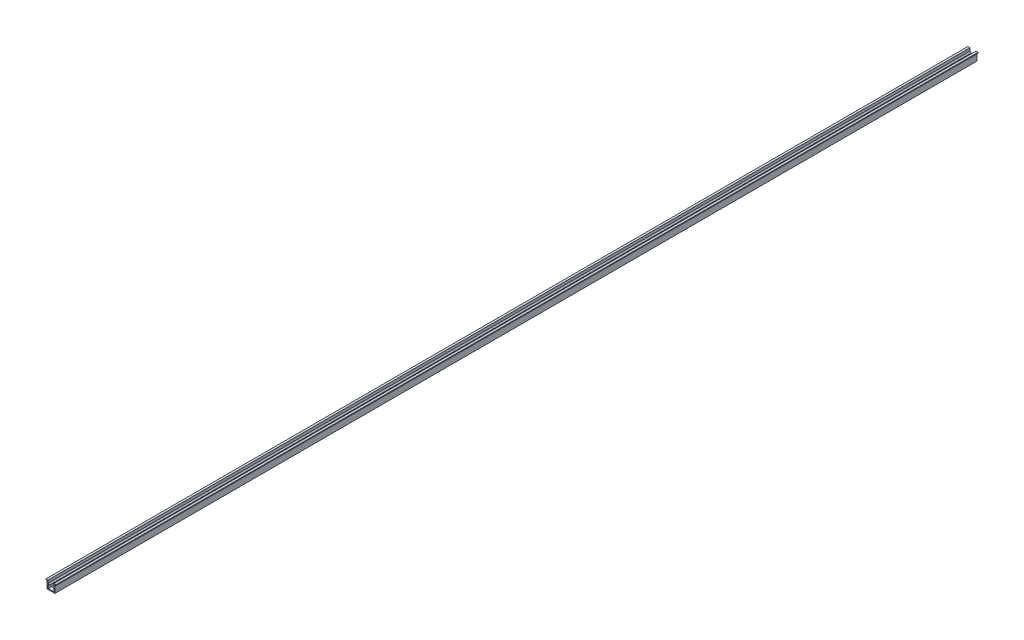
ISO-10303-21;
HEADER;
FILE_DESCRIPTION(('STEP AP214'),'2;1');
FILE_NAME('part.step','',(''),(''),'','','');
FILE_SCHEMA(('AUTOMOTIVE_DESIGN { 1 0 10303 214 1 1 1 1 }'));
ENDSEC;
DATA;
#1=APPLICATION_CONTEXT('core data for automotive mechanical design processes');
#2=APPLICATION_PROTOCOL_DEFINITION('international standard','automotive_design',2000,#1);
#3=PRODUCT_CONTEXT('',#1,'mechanical');
#4=PRODUCT('Part','Part','',(#3));
#5=PRODUCT_RELATED_PRODUCT_CATEGORY('part','',(#4));
#6=PRODUCT_DEFINITION_FORMATION('','',#4);
#7=PRODUCT_DEFINITION_CONTEXT('part definition',#1,'design');
#8=PRODUCT_DEFINITION('design','',#6,#7);
#9=PRODUCT_DEFINITION_SHAPE('','',#8);
#10=(LENGTH_UNIT() NAMED_UNIT(*) SI_UNIT(.MILLI.,.METRE.));
#11=(NAMED_UNIT(*) PLANE_ANGLE_UNIT() SI_UNIT($,.RADIAN.));
#12=(NAMED_UNIT(*) SI_UNIT($,.STERADIAN.) SOLID_ANGLE_UNIT());
#13=UNCERTAINTY_MEASURE_WITH_UNIT(LENGTH_MEASURE(1.E-05),#10,'distance_accuracy_value','');
#14=(GEOMETRIC_REPRESENTATION_CONTEXT(3) GLOBAL_UNCERTAINTY_ASSIGNED_CONTEXT((#13)) GLOBAL_UNIT_ASSIGNED_CONTEXT((#10,
#11,#12)) REPRESENTATION_CONTEXT('',''));
#15=CARTESIAN_POINT('',(0.,0.,0.));
#16=DIRECTION('',(0.,0.,1.));
#17=DIRECTION('',(1.,0.,0.));
#18=AXIS2_PLACEMENT_3D('',#15,#16,#17);
#19=CARTESIAN_POINT('',(-4.15,0.,1000.));
#20=DIRECTION('',(1.,0.,0.));
#21=DIRECTION('',(0.,0.,-1.));
#22=AXIS2_PLACEMENT_3D('',#19,#20,#21);
#23=PLANE('',#22);
#24=DIRECTION('',(0.,-1.,0.));
#25=VECTOR('',#24,1.);
#26=CARTESIAN_POINT('',(-4.15,0.,0.));
#27=LINE('',#26,#25);
#28=CARTESIAN_POINT('',(-4.15,8.,0.));
#29=VERTEX_POINT('',#28);
#30=CARTESIAN_POINT('',(-4.15,0.,0.));
#31=VERTEX_POINT('',#30);
#32=EDGE_CURVE('E203',#29,#31,#27,.T.);
#33=ORIENTED_EDGE('',*,*,#32,.T.);
#34=DIRECTION('',(0.,0.,-1.));
#35=VECTOR('',#34,1.);
#36=CARTESIAN_POINT('',(-4.15,0.,1000.));
#37=LINE('',#36,#35);
#38=CARTESIAN_POINT('',(-4.15,0.,1000.));
#39=VERTEX_POINT('',#38);
#40=EDGE_CURVE('E11',#39,#31,#37,.T.);
#41=ORIENTED_EDGE('',*,*,#40,.F.);
#42=DIRECTION('',(0.,-1.,0.));
#43=VECTOR('',#42,1.);
#44=CARTESIAN_POINT('',(-4.15,0.,1000.));
#45=LINE('',#44,#43);
#46=CARTESIAN_POINT('',(-4.15,8.,1000.));
#47=VERTEX_POINT('',#46);
#48=EDGE_CURVE('E241',#47,#39,#45,.T.);
#49=ORIENTED_EDGE('',*,*,#48,.F.);
#50=DIRECTION('',(0.,0.,-1.));
#51=VECTOR('',#50,1.);
#52=CARTESIAN_POINT('',(-4.15,8.,1000.));
#53=LINE('',#52,#51);
#54=EDGE_CURVE('E199',#47,#29,#53,.T.);
#55=ORIENTED_EDGE('',*,*,#54,.T.);
#56=EDGE_LOOP('',(#33,#41,#49,#55));
#57=FACE_BOUND('',#56,.T.);
#58=ADVANCED_FACE('F35',(#57),#23,.F.);
#59=CARTESIAN_POINT('',(4.15,0.,1000.));
#60=DIRECTION('',(0.,1.,0.));
#61=DIRECTION('',(-1.,0.,0.));
#62=AXIS2_PLACEMENT_3D('',#59,#60,#61);
#63=PLANE('',#62);
#64=DIRECTION('',(1.,0.,0.));
#65=VECTOR('',#64,1.);
#66=CARTESIAN_POINT('',(4.15,0.,0.));
#67=LINE('',#66,#65);
#68=CARTESIAN_POINT('',(4.15,0.,0.));
#69=VERTEX_POINT('',#68);
#70=EDGE_CURVE('E206',#31,#69,#67,.T.);
#71=ORIENTED_EDGE('',*,*,#70,.T.);
#72=DIRECTION('',(0.,0.,-1.));
#73=VECTOR('',#72,1.);
#74=CARTESIAN_POINT('',(4.15,0.,1000.));
#75=LINE('',#74,#73);
#76=CARTESIAN_POINT('',(4.15,0.,1000.));
#77=VERTEX_POINT('',#76);
#78=EDGE_CURVE('E43',#77,#69,#75,.T.);
#79=ORIENTED_EDGE('',*,*,#78,.F.);
#80=DIRECTION('',(1.,0.,0.));
#81=VECTOR('',#80,1.);
#82=CARTESIAN_POINT('',(4.15,0.,1000.));
#83=LINE('',#82,#81);
#84=EDGE_CURVE('E130',#39,#77,#83,.T.);
#85=ORIENTED_EDGE('',*,*,#84,.F.);
#86=ORIENTED_EDGE('',*,*,#40,.T.);
#87=EDGE_LOOP('',(#71,#79,#85,#86));
#88=FACE_BOUND('',#87,.T.);
#89=ADVANCED_FACE('F359',(#88),#63,.F.);
#90=CARTESIAN_POINT('',(4.15,0.,1000.));
#91=DIRECTION('',(-1.,0.,0.));
#92=DIRECTION('',(0.,0.,1.));
#93=AXIS2_PLACEMENT_3D('',#90,#91,#92);
#94=PLANE('',#93);
#95=DIRECTION('',(0.,1.,0.));
#96=VECTOR('',#95,1.);
#97=CARTESIAN_POINT('',(4.15,0.,0.));
#98=LINE('',#97,#96);
#99=CARTESIAN_POINT('',(4.15,8.,0.));
#100=VERTEX_POINT('',#99);
#101=EDGE_CURVE('E208',#69,#100,#98,.T.);
#102=ORIENTED_EDGE('',*,*,#101,.T.);
#103=DIRECTION('',(0.,0.,-1.));
#104=VECTOR('',#103,1.);
#105=CARTESIAN_POINT('',(4.15,8.,1000.));
#106=LINE('',#105,#104);
#107=CARTESIAN_POINT('',(4.15,8.,1000.));
#108=VERTEX_POINT('',#107);
#109=EDGE_CURVE('E284',#108,#100,#106,.T.);
#110=ORIENTED_EDGE('',*,*,#109,.F.);
#111=DIRECTION('',(0.,1.,0.));
#112=VECTOR('',#111,1.);
#113=CARTESIAN_POINT('',(4.15,0.,1000.));
#114=LINE('',#113,#112);
#115=EDGE_CURVE('E292',#77,#108,#114,.T.);
#116=ORIENTED_EDGE('',*,*,#115,.F.);
#117=ORIENTED_EDGE('',*,*,#78,.T.);
#118=EDGE_LOOP('',(#102,#110,#116,#117));
#119=FACE_BOUND('',#118,.T.);
#120=ADVANCED_FACE('F290',(#119),#94,.F.);
#121=CARTESIAN_POINT('',(4.15,8.,1000.));
#122=DIRECTION('',(0.,1.,0.));
#123=DIRECTION('',(-1.,0.,0.));
#124=AXIS2_PLACEMENT_3D('',#121,#122,#123);
#125=PLANE('',#124);
#126=DIRECTION('',(1.,0.,0.));
#127=VECTOR('',#126,1.);
#128=CARTESIAN_POINT('',(4.15,8.,0.));
#129=LINE('',#128,#127);
#130=CARTESIAN_POINT('',(5.5,8.,0.));
#131=VERTEX_POINT('',#130);
#132=EDGE_CURVE('E210',#100,#131,#129,.T.);
#133=ORIENTED_EDGE('',*,*,#132,.T.);
#134=DIRECTION('',(0.,0.,-1.));
#135=VECTOR('',#134,1.);
#136=CARTESIAN_POINT('',(5.5,8.,1000.));
#137=LINE('',#136,#135);
#138=CARTESIAN_POINT('',(5.5,8.,1000.));
#139=VERTEX_POINT('',#138);
#140=EDGE_CURVE('E281',#139,#131,#137,.T.);
#141=ORIENTED_EDGE('',*,*,#140,.F.);
#142=DIRECTION('',(1.,0.,0.));
#143=VECTOR('',#142,1.);
#144=CARTESIAN_POINT('',(4.15,8.,1000.));
#145=LINE('',#144,#143);
#146=EDGE_CURVE('E310',#108,#139,#145,.T.);
#147=ORIENTED_EDGE('',*,*,#146,.F.);
#148=ORIENTED_EDGE('',*,*,#109,.T.);
#149=EDGE_LOOP('',(#133,#141,#147,#148));
#150=FACE_BOUND('',#149,.T.);
#151=ADVANCED_FACE('F301',(#150),#125,.F.);
#152=CARTESIAN_POINT('',(5.5,8.,1000.));
#153=DIRECTION('',(-1.,0.,0.));
#154=DIRECTION('',(0.,0.,1.));
#155=AXIS2_PLACEMENT_3D('',#152,#153,#154);
#156=PLANE('',#155);
#157=DIRECTION('',(0.,1.,0.));
#158=VECTOR('',#157,1.);
#159=CARTESIAN_POINT('',(5.5,8.,0.));
#160=LINE('',#159,#158);
#161=CARTESIAN_POINT('',(5.5,9.,0.));
#162=VERTEX_POINT('',#161);
#163=EDGE_CURVE('E212',#131,#162,#160,.T.);
#164=ORIENTED_EDGE('',*,*,#163,.T.);
#165=DIRECTION('',(0.,0.,-1.));
#166=VECTOR('',#165,1.);
#167=CARTESIAN_POINT('',(5.5,9.,1000.));
#168=LINE('',#167,#166);
#169=CARTESIAN_POINT('',(5.5,9.,1000.));
#170=VERTEX_POINT('',#169);
#171=EDGE_CURVE('E278',#170,#162,#168,.T.);
#172=ORIENTED_EDGE('',*,*,#171,.F.);
#173=DIRECTION('',(0.,1.,0.));
#174=VECTOR('',#173,1.);
#175=CARTESIAN_POINT('',(5.5,8.,1000.));
#176=LINE('',#175,#174);
#177=EDGE_CURVE('E307',#139,#170,#176,.T.);
#178=ORIENTED_EDGE('',*,*,#177,.F.);
#179=ORIENTED_EDGE('',*,*,#140,.T.);
#180=EDGE_LOOP('',(#164,#172,#178,#179));
#181=FACE_BOUND('',#180,.T.);
#182=ADVANCED_FACE('F305',(#181),#156,.F.);
#183=CARTESIAN_POINT('',(5.5,9.,1000.));
#184=DIRECTION('',(0.,-1.,0.));
#185=DIRECTION('',(1.,0.,0.));
#186=AXIS2_PLACEMENT_3D('',#183,#184,#185);
#187=PLANE('',#186);
#188=DIRECTION('',(-1.,0.,0.));
#189=VECTOR('',#188,1.);
#190=CARTESIAN_POINT('',(5.5,9.,0.));
#191=LINE('',#190,#189);
#192=CARTESIAN_POINT('',(3.15,9.,0.));
#193=VERTEX_POINT('',#192);
#194=EDGE_CURVE('E214',#162,#193,#191,.T.);
#195=ORIENTED_EDGE('',*,*,#194,.T.);
#196=DIRECTION('',(0.,0.,-1.));
#197=VECTOR('',#196,1.);
#198=CARTESIAN_POINT('',(3.15,9.,1000.));
#199=LINE('',#198,#197);
#200=CARTESIAN_POINT('',(3.15,9.,1000.));
#201=VERTEX_POINT('',#200);
#202=EDGE_CURVE('E275',#201,#193,#199,.T.);
#203=ORIENTED_EDGE('',*,*,#202,.F.);
#204=DIRECTION('',(-1.,0.,0.));
#205=VECTOR('',#204,1.);
#206=CARTESIAN_POINT('',(5.5,9.,1000.));
#207=LINE('',#206,#205);
#208=EDGE_CURVE('E309',#170,#201,#207,.T.);
#209=ORIENTED_EDGE('',*,*,#208,.F.);
#210=ORIENTED_EDGE('',*,*,#171,.T.);
#211=EDGE_LOOP('',(#195,#203,#209,#210));
#212=FACE_BOUND('',#211,.T.);
#213=ADVANCED_FACE('F372',(#212),#187,.F.);
#214=CARTESIAN_POINT('',(3.15,9.,1000.));
#215=DIRECTION('',(1.,0.,0.));
#216=DIRECTION('',(0.,1.,0.));
#217=AXIS2_PLACEMENT_3D('',#214,#215,#216);
#218=PLANE('',#217);
#219=DIRECTION('',(0.,-1.,0.));
#220=VECTOR('',#219,1.);
#221=CARTESIAN_POINT('',(3.15,9.,0.));
#222=LINE('',#221,#220);
#223=CARTESIAN_POINT('',(3.15,6.,0.));
#224=VERTEX_POINT('',#223);
#225=EDGE_CURVE('E216',#193,#224,#222,.T.);
#226=ORIENTED_EDGE('',*,*,#225,.T.);
#227=DIRECTION('',(0.,0.,-1.));
#228=VECTOR('',#227,1.);
#229=CARTESIAN_POINT('',(3.15,6.,1000.));
#230=LINE('',#229,#228);
#231=CARTESIAN_POINT('',(3.15,6.,1000.));
#232=VERTEX_POINT('',#231);
#233=EDGE_CURVE('E272',#232,#224,#230,.T.);
#234=ORIENTED_EDGE('',*,*,#233,.F.);
#235=DIRECTION('',(0.,-1.,0.));
#236=VECTOR('',#235,1.);
#237=CARTESIAN_POINT('',(3.15,9.,1000.));
#238=LINE('',#237,#236);
#239=EDGE_CURVE('E312',#201,#232,#238,.T.);
#240=ORIENTED_EDGE('',*,*,#239,.F.);
#241=ORIENTED_EDGE('',*,*,#202,.T.);
#242=EDGE_LOOP('',(#226,#234,#240,#241));
#243=FACE_BOUND('',#242,.T.);
#244=ADVANCED_FACE('F375',(#243),#218,.F.);
#245=CARTESIAN_POINT('',(3.15,6.,1000.));
#246=DIRECTION('',(0.707106781186546,-0.707106781186549,0.));
#247=DIRECTION('',(0.707106781186549,0.707106781186546,0.));
#248=AXIS2_PLACEMENT_3D('',#245,#246,#247);
#249=PLANE('',#248);
#250=DIRECTION('',(-0.707106781186549,-0.707106781186546,0.));
#251=VECTOR('',#250,1.);
#252=CARTESIAN_POINT('',(3.15,6.,0.));
#253=LINE('',#252,#251);
#254=CARTESIAN_POINT('',(1.87720779386421,4.72720779386422,0.));
#255=VERTEX_POINT('',#254);
#256=EDGE_CURVE('E218',#224,#255,#253,.T.);
#257=ORIENTED_EDGE('',*,*,#256,.T.);
#258=DIRECTION('',(0.,0.,-1.));
#259=VECTOR('',#258,1.);
#260=CARTESIAN_POINT('',(1.87720779386421,4.72720779386422,1000.));
#261=LINE('',#260,#259);
#262=CARTESIAN_POINT('',(1.87720779386421,4.72720779386422,1000.));
#263=VERTEX_POINT('',#262);
#264=EDGE_CURVE('E269',#263,#255,#261,.T.);
#265=ORIENTED_EDGE('',*,*,#264,.F.);
#266=DIRECTION('',(-0.707106781186549,-0.707106781186546,0.));
#267=VECTOR('',#266,1.);
#268=CARTESIAN_POINT('',(3.15,6.,1000.));
#269=LINE('',#268,#267);
#270=EDGE_CURVE('E318',#232,#263,#269,.T.);
#271=ORIENTED_EDGE('',*,*,#270,.F.);
#272=ORIENTED_EDGE('',*,*,#233,.T.);
#273=EDGE_LOOP('',(#257,#265,#271,#272));
#274=FACE_BOUND('',#273,.T.);
#275=ADVANCED_FACE('F379',(#274),#249,.F.);
#276=CARTESIAN_POINT('',(1.87720779386421,4.72720779386422,1000.));
#277=DIRECTION('',(0.707106781186549,0.707106781186546,0.));
#278=DIRECTION('',(-0.707106781186546,0.707106781186549,0.));
#279=AXIS2_PLACEMENT_3D('',#276,#277,#278);
#280=PLANE('',#279);
#281=DIRECTION('',(0.707106781186546,-0.707106781186549,0.));
#282=VECTOR('',#281,1.);
#283=CARTESIAN_POINT('',(1.87720779386421,4.72720779386422,0.));
#284=LINE('',#283,#282);
#285=CARTESIAN_POINT('',(2.44289321881345,4.16152236891498,0.));
#286=VERTEX_POINT('',#285);
#287=EDGE_CURVE('E220',#255,#286,#284,.T.);
#288=ORIENTED_EDGE('',*,*,#287,.T.);
#289=DIRECTION('',(0.,0.,-1.));
#290=VECTOR('',#289,1.);
#291=CARTESIAN_POINT('',(2.44289321881345,4.16152236891498,1000.));
#292=LINE('',#291,#290);
#293=CARTESIAN_POINT('',(2.44289321881345,4.16152236891498,1000.));
#294=VERTEX_POINT('',#293);
#295=EDGE_CURVE('E266',#294,#286,#292,.T.);
#296=ORIENTED_EDGE('',*,*,#295,.F.);
#297=DIRECTION('',(0.707106781186546,-0.707106781186549,0.));
#298=VECTOR('',#297,1.);
#299=CARTESIAN_POINT('',(1.87720779386421,4.72720779386422,1000.));
#300=LINE('',#299,#298);
#301=EDGE_CURVE('E320',#263,#294,#300,.T.);
#302=ORIENTED_EDGE('',*,*,#301,.F.);
#303=ORIENTED_EDGE('',*,*,#264,.T.);
#304=EDGE_LOOP('',(#288,#296,#302,#303));
#305=FACE_BOUND('',#304,.T.);
#306=ADVANCED_FACE('F383',(#305),#280,.F.);
#307=CARTESIAN_POINT('',(2.44289321881345,4.16152236891498,1000.));
#308=DIRECTION('',(-0.707106781186546,0.707106781186549,0.));
#309=DIRECTION('',(-0.707106781186549,-0.707106781186546,0.));
#310=AXIS2_PLACEMENT_3D('',#307,#308,#309);
#311=PLANE('',#310);
#312=DIRECTION('',(0.707106781186549,0.707106781186546,0.));
#313=VECTOR('',#312,1.);
#314=CARTESIAN_POINT('',(2.44289321881345,4.16152236891498,0.));
#315=LINE('',#314,#313);
#316=CARTESIAN_POINT('',(3.15,4.86862915010153,0.));
#317=VERTEX_POINT('',#316);
#318=EDGE_CURVE('E222',#286,#317,#315,.T.);
#319=ORIENTED_EDGE('',*,*,#318,.T.);
#320=DIRECTION('',(0.,0.,-1.));
#321=VECTOR('',#320,1.);
#322=CARTESIAN_POINT('',(3.15,4.86862915010153,1000.));
#323=LINE('',#322,#321);
#324=CARTESIAN_POINT('',(3.15,4.86862915010153,1000.));
#325=VERTEX_POINT('',#324);
#326=EDGE_CURVE('E263',#325,#317,#323,.T.);
#327=ORIENTED_EDGE('',*,*,#326,.F.);
#328=DIRECTION('',(0.707106781186549,0.707106781186546,0.));
#329=VECTOR('',#328,1.);
#330=CARTESIAN_POINT('',(2.44289321881345,4.16152236891498,1000.));
#331=LINE('',#330,#329);
#332=EDGE_CURVE('E322',#294,#325,#331,.T.);
#333=ORIENTED_EDGE('',*,*,#332,.F.);
#334=ORIENTED_EDGE('',*,*,#295,.T.);
#335=EDGE_LOOP('',(#319,#327,#333,#334));
#336=FACE_BOUND('',#335,.T.);
#337=ADVANCED_FACE('F387',(#336),#311,.F.);
#338=CARTESIAN_POINT('',(3.15,4.86862915010153,1000.));
#339=DIRECTION('',(1.,0.,0.));
#340=DIRECTION('',(0.,1.,0.));
#341=AXIS2_PLACEMENT_3D('',#338,#339,#340);
#342=PLANE('',#341);
#343=DIRECTION('',(0.,-1.,0.));
#344=VECTOR('',#343,1.);
#345=CARTESIAN_POINT('',(3.15,4.86862915010153,0.));
#346=LINE('',#345,#344);
#347=CARTESIAN_POINT('',(3.15,1.,0.));
#348=VERTEX_POINT('',#347);
#349=EDGE_CURVE('E224',#317,#348,#346,.T.);
#350=ORIENTED_EDGE('',*,*,#349,.T.);
#351=DIRECTION('',(0.,0.,-1.));
#352=VECTOR('',#351,1.);
#353=CARTESIAN_POINT('',(3.15,1.,1000.));
#354=LINE('',#353,#352);
#355=CARTESIAN_POINT('',(3.15,1.,1000.));
#356=VERTEX_POINT('',#355);
#357=EDGE_CURVE('E260',#356,#348,#354,.T.);
#358=ORIENTED_EDGE('',*,*,#357,.F.);
#359=DIRECTION('',(0.,-1.,0.));
#360=VECTOR('',#359,1.);
#361=CARTESIAN_POINT('',(3.15,4.86862915010153,1000.));
#362=LINE('',#361,#360);
#363=EDGE_CURVE('E324',#325,#356,#362,.T.);
#364=ORIENTED_EDGE('',*,*,#363,.F.);
#365=ORIENTED_EDGE('',*,*,#326,.T.);
#366=EDGE_LOOP('',(#350,#358,#364,#365));
#367=FACE_BOUND('',#366,.T.);
#368=ADVANCED_FACE('F391',(#367),#342,.F.);
#369=CARTESIAN_POINT('',(-3.15,1.,1000.));
#370=DIRECTION('',(0.,-1.,0.));
#371=DIRECTION('',(1.,0.,0.));
#372=AXIS2_PLACEMENT_3D('',#369,#370,#371);
#373=PLANE('',#372);
#374=DIRECTION('',(-1.,0.,0.));
#375=VECTOR('',#374,1.);
#376=CARTESIAN_POINT('',(-3.15,1.,0.));
#377=LINE('',#376,#375);
#378=CARTESIAN_POINT('',(-3.15,1.,0.));
#379=VERTEX_POINT('',#378);
#380=EDGE_CURVE('E226',#348,#379,#377,.T.);
#381=ORIENTED_EDGE('',*,*,#380,.T.);
#382=DIRECTION('',(0.,0.,-1.));
#383=VECTOR('',#382,1.);
#384=CARTESIAN_POINT('',(-3.15,1.,1000.));
#385=LINE('',#384,#383);
#386=CARTESIAN_POINT('',(-3.15,1.,1000.));
#387=VERTEX_POINT('',#386);
#388=EDGE_CURVE('E257',#387,#379,#385,.T.);
#389=ORIENTED_EDGE('',*,*,#388,.F.);
#390=DIRECTION('',(-1.,0.,0.));
#391=VECTOR('',#390,1.);
#392=CARTESIAN_POINT('',(-3.15,1.,1000.));
#393=LINE('',#392,#391);
#394=EDGE_CURVE('E326',#356,#387,#393,.T.);
#395=ORIENTED_EDGE('',*,*,#394,.F.);
#396=ORIENTED_EDGE('',*,*,#357,.T.);
#397=EDGE_LOOP('',(#381,#389,#395,#396));
#398=FACE_BOUND('',#397,.T.);
#399=ADVANCED_FACE('F395',(#398),#373,.F.);
#400=CARTESIAN_POINT('',(-3.15,4.86862915010152,1000.));
#401=DIRECTION('',(-1.,0.,0.));
#402=DIRECTION('',(0.,-1.,0.));
#403=AXIS2_PLACEMENT_3D('',#400,#401,#402);
#404=PLANE('',#403);
#405=DIRECTION('',(0.,1.,0.));
#406=VECTOR('',#405,1.);
#407=CARTESIAN_POINT('',(-3.15,4.86862915010152,0.));
#408=LINE('',#407,#406);
#409=CARTESIAN_POINT('',(-3.15,4.86862915010152,0.));
#410=VERTEX_POINT('',#409);
#411=EDGE_CURVE('E228',#379,#410,#408,.T.);
#412=ORIENTED_EDGE('',*,*,#411,.T.);
#413=DIRECTION('',(0.,0.,-1.));
#414=VECTOR('',#413,1.);
#415=CARTESIAN_POINT('',(-3.15,4.86862915010152,1000.));
#416=LINE('',#415,#414);
#417=CARTESIAN_POINT('',(-3.15,4.86862915010152,1000.));
#418=VERTEX_POINT('',#417);
#419=EDGE_CURVE('E254',#418,#410,#416,.T.);
#420=ORIENTED_EDGE('',*,*,#419,.F.);
#421=DIRECTION('',(0.,1.,0.));
#422=VECTOR('',#421,1.);
#423=CARTESIAN_POINT('',(-3.15,4.86862915010152,1000.));
#424=LINE('',#423,#422);
#425=EDGE_CURVE('E328',#387,#418,#424,.T.);
#426=ORIENTED_EDGE('',*,*,#425,.F.);
#427=ORIENTED_EDGE('',*,*,#388,.T.);
#428=EDGE_LOOP('',(#412,#420,#426,#427));
#429=FACE_BOUND('',#428,.T.);
#430=ADVANCED_FACE('F399',(#429),#404,.F.);
#431=CARTESIAN_POINT('',(-2.44289321881345,4.16152236891498,1000.));
#432=DIRECTION('',(0.707106781186546,0.707106781186549,0.));
#433=DIRECTION('',(-0.707106781186549,0.707106781186546,0.));
#434=AXIS2_PLACEMENT_3D('',#431,#432,#433);
#435=PLANE('',#434);
#436=DIRECTION('',(0.707106781186549,-0.707106781186546,0.));
#437=VECTOR('',#436,1.);
#438=CARTESIAN_POINT('',(-2.44289321881345,4.16152236891498,0.));
#439=LINE('',#438,#437);
#440=CARTESIAN_POINT('',(-2.44289321881345,4.16152236891498,0.));
#441=VERTEX_POINT('',#440);
#442=EDGE_CURVE('E230',#410,#441,#439,.T.);
#443=ORIENTED_EDGE('',*,*,#442,.T.);
#444=DIRECTION('',(0.,0.,-1.));
#445=VECTOR('',#444,1.);
#446=CARTESIAN_POINT('',(-2.44289321881345,4.16152236891498,1000.));
#447=LINE('',#446,#445);
#448=CARTESIAN_POINT('',(-2.44289321881345,4.16152236891498,1000.));
#449=VERTEX_POINT('',#448);
#450=EDGE_CURVE('E251',#449,#441,#447,.T.);
#451=ORIENTED_EDGE('',*,*,#450,.F.);
#452=DIRECTION('',(0.707106781186549,-0.707106781186546,0.));
#453=VECTOR('',#452,1.);
#454=CARTESIAN_POINT('',(-2.44289321881345,4.16152236891498,1000.));
#455=LINE('',#454,#453);
#456=EDGE_CURVE('E330',#418,#449,#455,.T.);
#457=ORIENTED_EDGE('',*,*,#456,.F.);
#458=ORIENTED_EDGE('',*,*,#419,.T.);
#459=EDGE_LOOP('',(#443,#451,#457,#458));
#460=FACE_BOUND('',#459,.T.);
#461=ADVANCED_FACE('F403',(#460),#435,.F.);
#462=CARTESIAN_POINT('',(-1.87720779386421,4.72720779386422,1000.));
#463=DIRECTION('',(-0.70710678118655,0.707106781186545,0.));
#464=DIRECTION('',(-0.707106781186545,-0.70710678118655,0.));
#465=AXIS2_PLACEMENT_3D('',#462,#463,#464);
#466=PLANE('',#465);
#467=DIRECTION('',(0.707106781186545,0.70710678118655,0.));
#468=VECTOR('',#467,1.);
#469=CARTESIAN_POINT('',(-1.87720779386421,4.72720779386422,0.));
#470=LINE('',#469,#468);
#471=CARTESIAN_POINT('',(-1.87720779386421,4.72720779386422,0.));
#472=VERTEX_POINT('',#471);
#473=EDGE_CURVE('E232',#441,#472,#470,.T.);
#474=ORIENTED_EDGE('',*,*,#473,.T.);
#475=DIRECTION('',(0.,0.,-1.));
#476=VECTOR('',#475,1.);
#477=CARTESIAN_POINT('',(-1.87720779386421,4.72720779386422,1000.));
#478=LINE('',#477,#476);
#479=CARTESIAN_POINT('',(-1.87720779386421,4.72720779386422,1000.));
#480=VERTEX_POINT('',#479);
#481=EDGE_CURVE('E248',#480,#472,#478,.T.);
#482=ORIENTED_EDGE('',*,*,#481,.F.);
#483=DIRECTION('',(0.707106781186545,0.70710678118655,0.));
#484=VECTOR('',#483,1.);
#485=CARTESIAN_POINT('',(-1.87720779386421,4.72720779386422,1000.));
#486=LINE('',#485,#484);
#487=EDGE_CURVE('E332',#449,#480,#486,.T.);
#488=ORIENTED_EDGE('',*,*,#487,.F.);
#489=ORIENTED_EDGE('',*,*,#450,.T.);
#490=EDGE_LOOP('',(#474,#482,#488,#489));
#491=FACE_BOUND('',#490,.T.);
#492=ADVANCED_FACE('F407',(#491),#466,.F.);
#493=CARTESIAN_POINT('',(-3.15,6.,1000.));
#494=DIRECTION('',(-0.707106781186546,-0.707106781186549,0.));
#495=DIRECTION('',(0.707106781186549,-0.707106781186546,0.));
#496=AXIS2_PLACEMENT_3D('',#493,#494,#495);
#497=PLANE('',#496);
#498=DIRECTION('',(-0.707106781186549,0.707106781186546,0.));
#499=VECTOR('',#498,1.);
#500=CARTESIAN_POINT('',(-3.15,6.,0.));
#501=LINE('',#500,#499);
#502=CARTESIAN_POINT('',(-3.15,6.,0.));
#503=VERTEX_POINT('',#502);
#504=EDGE_CURVE('E234',#472,#503,#501,.T.);
#505=ORIENTED_EDGE('',*,*,#504,.T.);
#506=DIRECTION('',(0.,0.,-1.));
#507=VECTOR('',#506,1.);
#508=CARTESIAN_POINT('',(-3.15,6.,1000.));
#509=LINE('',#508,#507);
#510=CARTESIAN_POINT('',(-3.15,6.,1000.));
#511=VERTEX_POINT('',#510);
#512=EDGE_CURVE('E245',#511,#503,#509,.T.);
#513=ORIENTED_EDGE('',*,*,#512,.F.);
#514=DIRECTION('',(-0.707106781186549,0.707106781186546,0.));
#515=VECTOR('',#514,1.);
#516=CARTESIAN_POINT('',(-3.15,6.,1000.));
#517=LINE('',#516,#515);
#518=EDGE_CURVE('E334',#480,#511,#517,.T.);
#519=ORIENTED_EDGE('',*,*,#518,.F.);
#520=ORIENTED_EDGE('',*,*,#481,.T.);
#521=EDGE_LOOP('',(#505,#513,#519,#520));
#522=FACE_BOUND('',#521,.T.);
#523=ADVANCED_FACE('F340',(#522),#497,.F.);
#524=CARTESIAN_POINT('',(-3.15,9.,1000.));
#525=DIRECTION('',(-1.,0.,0.));
#526=DIRECTION('',(0.,-1.,0.));
#527=AXIS2_PLACEMENT_3D('',#524,#525,#526);
#528=PLANE('',#527);
#529=DIRECTION('',(0.,1.,0.));
#530=VECTOR('',#529,1.);
#531=CARTESIAN_POINT('',(-3.15,9.,0.));
#532=LINE('',#531,#530);
#533=CARTESIAN_POINT('',(-3.15,9.,0.));
#534=VERTEX_POINT('',#533);
#535=EDGE_CURVE('E236',#503,#534,#532,.T.);
#536=ORIENTED_EDGE('',*,*,#535,.T.);
#537=DIRECTION('',(0.,0.,-1.));
#538=VECTOR('',#537,1.);
#539=CARTESIAN_POINT('',(-3.15,9.,1000.));
#540=LINE('',#539,#538);
#541=CARTESIAN_POINT('',(-3.15,9.,1000.));
#542=VERTEX_POINT('',#541);
#543=EDGE_CURVE('E194',#542,#534,#540,.T.);
#544=ORIENTED_EDGE('',*,*,#543,.F.);
#545=DIRECTION('',(0.,1.,0.));
#546=VECTOR('',#545,1.);
#547=CARTESIAN_POINT('',(-3.15,9.,1000.));
#548=LINE('',#547,#546);
#549=EDGE_CURVE('E185',#511,#542,#548,.T.);
#550=ORIENTED_EDGE('',*,*,#549,.F.);
#551=ORIENTED_EDGE('',*,*,#512,.T.);
#552=EDGE_LOOP('',(#536,#544,#550,#551));
#553=FACE_BOUND('',#552,.T.);
#554=ADVANCED_FACE('F344',(#553),#528,.F.);
#555=CARTESIAN_POINT('',(-5.5,9.,1000.));
#556=DIRECTION('',(0.,-1.,0.));
#557=DIRECTION('',(0.,0.,-1.));
#558=AXIS2_PLACEMENT_3D('',#555,#556,#557);
#559=PLANE('',#558);
#560=DIRECTION('',(-1.,0.,0.));
#561=VECTOR('',#560,1.);
#562=CARTESIAN_POINT('',(-5.5,9.,0.));
#563=LINE('',#562,#561);
#564=CARTESIAN_POINT('',(-5.5,9.,0.));
#565=VERTEX_POINT('',#564);
#566=EDGE_CURVE('E193',#534,#565,#563,.T.);
#567=ORIENTED_EDGE('',*,*,#566,.T.);
#568=DIRECTION('',(0.,0.,-1.));
#569=VECTOR('',#568,1.);
#570=CARTESIAN_POINT('',(-5.5,9.,1000.));
#571=LINE('',#570,#569);
#572=CARTESIAN_POINT('',(-5.5,9.,1000.));
#573=VERTEX_POINT('',#572);
#574=EDGE_CURVE('E190',#573,#565,#571,.T.);
#575=ORIENTED_EDGE('',*,*,#574,.F.);
#576=DIRECTION('',(-1.,0.,0.));
#577=VECTOR('',#576,1.);
#578=CARTESIAN_POINT('',(-5.5,9.,1000.));
#579=LINE('',#578,#577);
#580=EDGE_CURVE('E179',#542,#573,#579,.T.);
#581=ORIENTED_EDGE('',*,*,#580,.F.);
#582=ORIENTED_EDGE('',*,*,#543,.T.);
#583=EDGE_LOOP('',(#567,#575,#581,#582));
#584=FACE_BOUND('',#583,.T.);
#585=ADVANCED_FACE('F191',(#584),#559,.F.);
#586=CARTESIAN_POINT('',(-5.5,8.,1000.));
#587=DIRECTION('',(1.,0.,0.));
#588=DIRECTION('',(0.,0.,-1.));
#589=AXIS2_PLACEMENT_3D('',#586,#587,#588);
#590=PLANE('',#589);
#591=DIRECTION('',(0.,-1.,0.));
#592=VECTOR('',#591,1.);
#593=CARTESIAN_POINT('',(-5.5,8.,0.));
#594=LINE('',#593,#592);
#595=CARTESIAN_POINT('',(-5.5,8.,0.));
#596=VERTEX_POINT('',#595);
#597=EDGE_CURVE('E116',#565,#596,#594,.T.);
#598=ORIENTED_EDGE('',*,*,#597,.T.);
#599=DIRECTION('',(0.,0.,-1.));
#600=VECTOR('',#599,1.);
#601=CARTESIAN_POINT('',(-5.5,8.,1000.));
#602=LINE('',#601,#600);
#603=CARTESIAN_POINT('',(-5.5,8.,1000.));
#604=VERTEX_POINT('',#603);
#605=EDGE_CURVE('E195',#604,#596,#602,.T.);
#606=ORIENTED_EDGE('',*,*,#605,.F.);
#607=DIRECTION('',(0.,-1.,0.));
#608=VECTOR('',#607,1.);
#609=CARTESIAN_POINT('',(-5.5,8.,1000.));
#610=LINE('',#609,#608);
#611=EDGE_CURVE('E183',#573,#604,#610,.T.);
#612=ORIENTED_EDGE('',*,*,#611,.F.);
#613=ORIENTED_EDGE('',*,*,#574,.T.);
#614=EDGE_LOOP('',(#598,#606,#612,#613));
#615=FACE_BOUND('',#614,.T.);
#616=ADVANCED_FACE('F197',(#615),#590,.F.);
#617=CARTESIAN_POINT('',(-4.15,8.,1000.));
#618=DIRECTION('',(0.,1.,0.));
#619=DIRECTION('',(0.,0.,1.));
#620=AXIS2_PLACEMENT_3D('',#617,#618,#619);
#621=PLANE('',#620);
#622=DIRECTION('',(1.,0.,0.));
#623=VECTOR('',#622,1.);
#624=CARTESIAN_POINT('',(-4.15,8.,0.));
#625=LINE('',#624,#623);
#626=EDGE_CURVE('E122',#596,#29,#625,.T.);
#627=ORIENTED_EDGE('',*,*,#626,.T.);
#628=ORIENTED_EDGE('',*,*,#54,.F.);
#629=DIRECTION('',(1.,0.,0.));
#630=VECTOR('',#629,1.);
#631=CARTESIAN_POINT('',(-4.15,8.,1000.));
#632=LINE('',#631,#630);
#633=EDGE_CURVE('E51',#604,#47,#632,.T.);
#634=ORIENTED_EDGE('',*,*,#633,.F.);
#635=ORIENTED_EDGE('',*,*,#605,.T.);
#636=EDGE_LOOP('',(#627,#628,#634,#635));
#637=FACE_BOUND('',#636,.T.);
#638=ADVANCED_FACE('F348',(#637),#621,.F.);
#639=CARTESIAN_POINT('',(0.,0.,1000.));
#640=DIRECTION('',(0.,0.,1.));
#641=DIRECTION('',(1.,0.,0.));
#642=AXIS2_PLACEMENT_3D('',#639,#640,#641);
#643=PLANE('',#642);
#644=ORIENTED_EDGE('',*,*,#48,.T.);
#645=ORIENTED_EDGE('',*,*,#84,.T.);
#646=ORIENTED_EDGE('',*,*,#115,.T.);
#647=ORIENTED_EDGE('',*,*,#146,.T.);
#648=ORIENTED_EDGE('',*,*,#177,.T.);
#649=ORIENTED_EDGE('',*,*,#208,.T.);
#650=ORIENTED_EDGE('',*,*,#239,.T.);
#651=ORIENTED_EDGE('',*,*,#270,.T.);
#652=ORIENTED_EDGE('',*,*,#301,.T.);
#653=ORIENTED_EDGE('',*,*,#332,.T.);
#654=ORIENTED_EDGE('',*,*,#363,.T.);
#655=ORIENTED_EDGE('',*,*,#394,.T.);
#656=ORIENTED_EDGE('',*,*,#425,.T.);
#657=ORIENTED_EDGE('',*,*,#456,.T.);
#658=ORIENTED_EDGE('',*,*,#487,.T.);
#659=ORIENTED_EDGE('',*,*,#518,.T.);
#660=ORIENTED_EDGE('',*,*,#549,.T.);
#661=ORIENTED_EDGE('',*,*,#580,.T.);
#662=ORIENTED_EDGE('',*,*,#611,.T.);
#663=ORIENTED_EDGE('',*,*,#633,.T.);
#664=EDGE_LOOP('',(#644,#645,#646,#647,#648,#649,#650,#651,#652,#653,#654,#655,#656,#657,#658,
#659,#660,#661,#662,#663));
#665=FACE_BOUND('',#664,.T.);
#666=ADVANCED_FACE('F181',(#665),#643,.T.);
#667=CARTESIAN_POINT('',(0.,0.,0.));
#668=DIRECTION('',(0.,0.,1.));
#669=DIRECTION('',(1.,0.,0.));
#670=AXIS2_PLACEMENT_3D('',#667,#668,#669);
#671=PLANE('',#670);
#672=ORIENTED_EDGE('',*,*,#32,.F.);
#673=ORIENTED_EDGE('',*,*,#626,.F.);
#674=ORIENTED_EDGE('',*,*,#597,.F.);
#675=ORIENTED_EDGE('',*,*,#566,.F.);
#676=ORIENTED_EDGE('',*,*,#535,.F.);
#677=ORIENTED_EDGE('',*,*,#504,.F.);
#678=ORIENTED_EDGE('',*,*,#473,.F.);
#679=ORIENTED_EDGE('',*,*,#442,.F.);
#680=ORIENTED_EDGE('',*,*,#411,.F.);
#681=ORIENTED_EDGE('',*,*,#380,.F.);
#682=ORIENTED_EDGE('',*,*,#349,.F.);
#683=ORIENTED_EDGE('',*,*,#318,.F.);
#684=ORIENTED_EDGE('',*,*,#287,.F.);
#685=ORIENTED_EDGE('',*,*,#256,.F.);
#686=ORIENTED_EDGE('',*,*,#225,.F.);
#687=ORIENTED_EDGE('',*,*,#194,.F.);
#688=ORIENTED_EDGE('',*,*,#163,.F.);
#689=ORIENTED_EDGE('',*,*,#132,.F.);
#690=ORIENTED_EDGE('',*,*,#101,.F.);
#691=ORIENTED_EDGE('',*,*,#70,.F.);
#692=EDGE_LOOP('',(#672,#673,#674,#675,#676,#677,#678,#679,#680,#681,#682,#683,#684,#685,#686,
#687,#688,#689,#690,#691));
#693=FACE_BOUND('',#692,.T.);
#694=ADVANCED_FACE('F296',(#693),#671,.F.);
#695=CLOSED_SHELL('',(#58,#89,#120,#151,#182,#213,#244,#275,#306,#337,#368,#399,#430,#461,#492,
#523,#554,#585,#616,#638,#666,#694));
#696=MANIFOLD_SOLID_BREP('B2',#695);
#697=ADVANCED_BREP_SHAPE_REPRESENTATION('',(#18,#696),#14);
#698=SHAPE_DEFINITION_REPRESENTATION(#9,#697);
ENDSEC;
END-ISO-10303-21;
